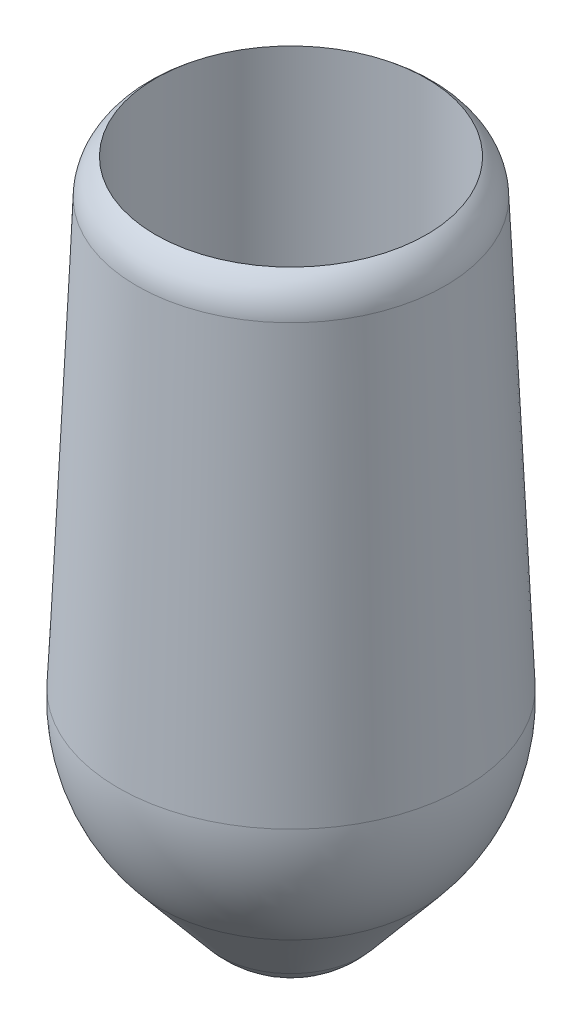
ISO-10303-21;
HEADER;
FILE_DESCRIPTION(('STEP AP214'),'2;1');
FILE_NAME('part.step','',(''),(''),'','','');
FILE_SCHEMA(('AUTOMOTIVE_DESIGN { 1 0 10303 214 1 1 1 1 }'));
ENDSEC;
DATA;
#1=APPLICATION_CONTEXT('core data for automotive mechanical design processes');
#2=APPLICATION_PROTOCOL_DEFINITION('international standard','automotive_design',2000,#1);
#3=PRODUCT_CONTEXT('',#1,'mechanical');
#4=PRODUCT('Part','Part','',(#3));
#5=PRODUCT_RELATED_PRODUCT_CATEGORY('part','',(#4));
#6=PRODUCT_DEFINITION_FORMATION('','',#4);
#7=PRODUCT_DEFINITION_CONTEXT('part definition',#1,'design');
#8=PRODUCT_DEFINITION('design','',#6,#7);
#9=PRODUCT_DEFINITION_SHAPE('','',#8);
#10=(LENGTH_UNIT() NAMED_UNIT(*) SI_UNIT(.MILLI.,.METRE.));
#11=(NAMED_UNIT(*) PLANE_ANGLE_UNIT() SI_UNIT($,.RADIAN.));
#12=(NAMED_UNIT(*) SI_UNIT($,.STERADIAN.) SOLID_ANGLE_UNIT());
#13=UNCERTAINTY_MEASURE_WITH_UNIT(LENGTH_MEASURE(1.E-05),#10,'distance_accuracy_value','');
#14=(GEOMETRIC_REPRESENTATION_CONTEXT(3) GLOBAL_UNCERTAINTY_ASSIGNED_CONTEXT((#13)) GLOBAL_UNIT_ASSIGNED_CONTEXT((#10,
#11,#12)) REPRESENTATION_CONTEXT('',''));
#15=CARTESIAN_POINT('',(0.,0.,0.));
#16=DIRECTION('',(0.,0.,1.));
#17=DIRECTION('',(1.,0.,0.));
#18=AXIS2_PLACEMENT_3D('',#15,#16,#17);
#19=CARTESIAN_POINT('',(0.,0.,0.));
#20=DIRECTION('',(0.,1.,0.));
#21=DIRECTION('',(0.,0.,1.));
#22=AXIS2_PLACEMENT_3D('',#19,#20,#21);
#23=PLANE('',#22);
#24=CARTESIAN_POINT('',(0.,0.,0.));
#25=DIRECTION('',(0.,1.,0.));
#26=DIRECTION('',(0.,0.,1.));
#27=AXIS2_PLACEMENT_3D('',#24,#25,#26);
#28=CIRCLE('',#27,2.942);
#29=CARTESIAN_POINT('',(0.,0.,2.942));
#30=VERTEX_POINT('',#29);
#31=EDGE_CURVE('E18',#30,#30,#28,.T.);
#32=ORIENTED_EDGE('',*,*,#31,.T.);
#33=EDGE_LOOP('',(#32));
#34=FACE_BOUND('',#33,.T.);
#35=ADVANCED_FACE('F14',(#34),#23,.T.);
#36=CARTESIAN_POINT('',(0.,-3.,0.));
#37=DIRECTION('',(1.,0.,0.));
#38=DIRECTION('',(0.,1.,0.));
#39=AXIS2_PLACEMENT_3D('',#36,#37,#38);
#40=SPHERICAL_SURFACE('',#39,2.);
#41=CARTESIAN_POINT('',(0.,-4.28190610824686,0.));
#42=DIRECTION('',(0.,1.,0.));
#43=DIRECTION('',(0.,0.,1.));
#44=AXIS2_PLACEMENT_3D('',#41,#42,#43);
#45=CIRCLE('',#44,1.53516016415751);
#46=CARTESIAN_POINT('',(0.,-4.28190610824686,1.53516016415751));
#47=VERTEX_POINT('',#46);
#48=EDGE_CURVE('E61',#47,#47,#45,.T.);
#49=ORIENTED_EDGE('',*,*,#48,.F.);
#50=EDGE_LOOP('',(#49));
#51=FACE_BOUND('',#50,.T.);
#52=ADVANCED_FACE('F53',(#51),#40,.T.);
#53=CARTESIAN_POINT('',(0.,5.,0.));
#54=DIRECTION('',(0.,1.,0.));
#55=DIRECTION('',(0.,0.,1.));
#56=AXIS2_PLACEMENT_3D('',#53,#54,#55);
#57=CYLINDRICAL_SURFACE('',#56,2.942);
#58=ORIENTED_EDGE('',*,*,#31,.F.);
#59=EDGE_LOOP('',(#58));
#60=FACE_BOUND('',#59,.T.);
#61=CARTESIAN_POINT('',(0.,10.,0.));
#62=DIRECTION('',(0.,1.,0.));
#63=DIRECTION('',(0.,0.,1.));
#64=AXIS2_PLACEMENT_3D('',#61,#62,#63);
#65=CIRCLE('',#64,2.942);
#66=CARTESIAN_POINT('',(0.,10.,2.942));
#67=VERTEX_POINT('',#66);
#68=EDGE_CURVE('E37',#67,#67,#65,.F.);
#69=ORIENTED_EDGE('',*,*,#68,.F.);
#70=EDGE_LOOP('',(#69));
#71=FACE_BOUND('',#70,.T.);
#72=ADVANCED_FACE('F49',(#60,#71),#57,.F.);
#73=CARTESIAN_POINT('',(0.,-2.73828976577306,0.));
#74=DIRECTION('',(0.,1.,0.));
#75=DIRECTION('',(0.,0.,1.));
#76=AXIS2_PLACEMENT_3D('',#73,#74,#75);
#77=CONICAL_SURFACE('',#76,2.82412744212479,0.695739257682413);
#78=ORIENTED_EDGE('',*,*,#48,.T.);
#79=EDGE_LOOP('',(#78));
#80=FACE_BOUND('',#79,.T.);
#81=CARTESIAN_POINT('',(0.,-2.73828976585977,0.));
#82=DIRECTION('',(0.,-1.,0.));
#83=DIRECTION('',(0.,0.,-1.));
#84=AXIS2_PLACEMENT_3D('',#81,#82,#83);
#85=CIRCLE('',#84,2.82412744208233);
#86=CARTESIAN_POINT('',(0.,-2.73828976585977,-2.82412744208233));
#87=VERTEX_POINT('',#86);
#88=EDGE_CURVE('E27',#87,#87,#85,.T.);
#89=ORIENTED_EDGE('',*,*,#88,.T.);
#90=EDGE_LOOP('',(#89));
#91=FACE_BOUND('',#90,.T.);
#92=ADVANCED_FACE('F44',(#80,#91),#77,.T.);
#93=CARTESIAN_POINT('',(0.,9.19586966198873,0.));
#94=DIRECTION('',(0.,1.,0.));
#95=DIRECTION('',(0.,0.,1.));
#96=AXIS2_PLACEMENT_3D('',#93,#94,#95);
#97=TOROIDAL_SURFACE('',#96,2.34754697453047,1.);
#98=CARTESIAN_POINT('',(0.,9.23948904937788,0.));
#99=DIRECTION('',(0.,-1.,0.));
#100=DIRECTION('',(0.,0.,1.));
#101=AXIS2_PLACEMENT_3D('',#98,#99,#100);
#102=CIRCLE('',#101,3.34659519611335);
#103=CARTESIAN_POINT('',(0.,9.23948904937788,3.34659519611336));
#104=VERTEX_POINT('',#103);
#105=EDGE_CURVE('E22',#104,#104,#102,.T.);
#106=ORIENTED_EDGE('',*,*,#105,.F.);
#107=EDGE_LOOP('',(#106));
#108=FACE_BOUND('',#107,.T.);
#109=ORIENTED_EDGE('',*,*,#68,.T.);
#110=EDGE_LOOP('',(#109));
#111=FACE_BOUND('',#110,.T.);
#112=ADVANCED_FACE('F40',(#108,#111),#97,.T.);
#113=CARTESIAN_POINT('',(0.,-0.174477549461344,0.));
#114=DIRECTION('',(0.,1.,0.));
#115=DIRECTION('',(0.,0.,1.));
#116=AXIS2_PLACEMENT_3D('',#113,#114,#115);
#117=DEGENERATE_TOROIDAL_SURFACE('',#116,0.246192886327453,4.00000000000002,.F.);
#118=ORIENTED_EDGE('',*,*,#88,.F.);
#119=EDGE_LOOP('',(#118));
#120=FACE_BOUND('',#119,.T.);
#121=CARTESIAN_POINT('',(0.,0.,0.));
#122=DIRECTION('',(0.,-1.,0.));
#123=DIRECTION('',(0.,0.,1.));
#124=AXIS2_PLACEMENT_3D('',#121,#122,#123);
#125=CIRCLE('',#124,3.75000000000014);
#126=CARTESIAN_POINT('',(0.,0.,3.75000000000014));
#127=VERTEX_POINT('',#126);
#128=EDGE_CURVE('E10',#127,#127,#125,.F.);
#129=ORIENTED_EDGE('',*,*,#128,.F.);
#130=EDGE_LOOP('',(#129));
#131=FACE_BOUND('',#130,.T.);
#132=ADVANCED_FACE('F16',(#120,#131),#117,.F.);
#133=CARTESIAN_POINT('',(0.,0.,0.));
#134=DIRECTION('',(0.,-1.,0.));
#135=DIRECTION('',(0.,0.,-1.));
#136=AXIS2_PLACEMENT_3D('',#133,#134,#135);
#137=CONICAL_SURFACE('',#136,3.75000000000014,0.0436332312997665);
#138=ORIENTED_EDGE('',*,*,#128,.T.);
#139=EDGE_LOOP('',(#138));
#140=FACE_BOUND('',#139,.T.);
#141=ORIENTED_EDGE('',*,*,#105,.T.);
#142=EDGE_LOOP('',(#141));
#143=FACE_BOUND('',#142,.T.);
#144=ADVANCED_FACE('F46',(#140,#143),#137,.T.);
#145=CLOSED_SHELL('',(#35,#52,#72,#92,#112,#132,#144));
#146=MANIFOLD_SOLID_BREP('B1',#145);
#147=ADVANCED_BREP_SHAPE_REPRESENTATION('',(#18,#146),#14);
#148=SHAPE_DEFINITION_REPRESENTATION(#9,#147);
ENDSEC;
END-ISO-10303-21;
